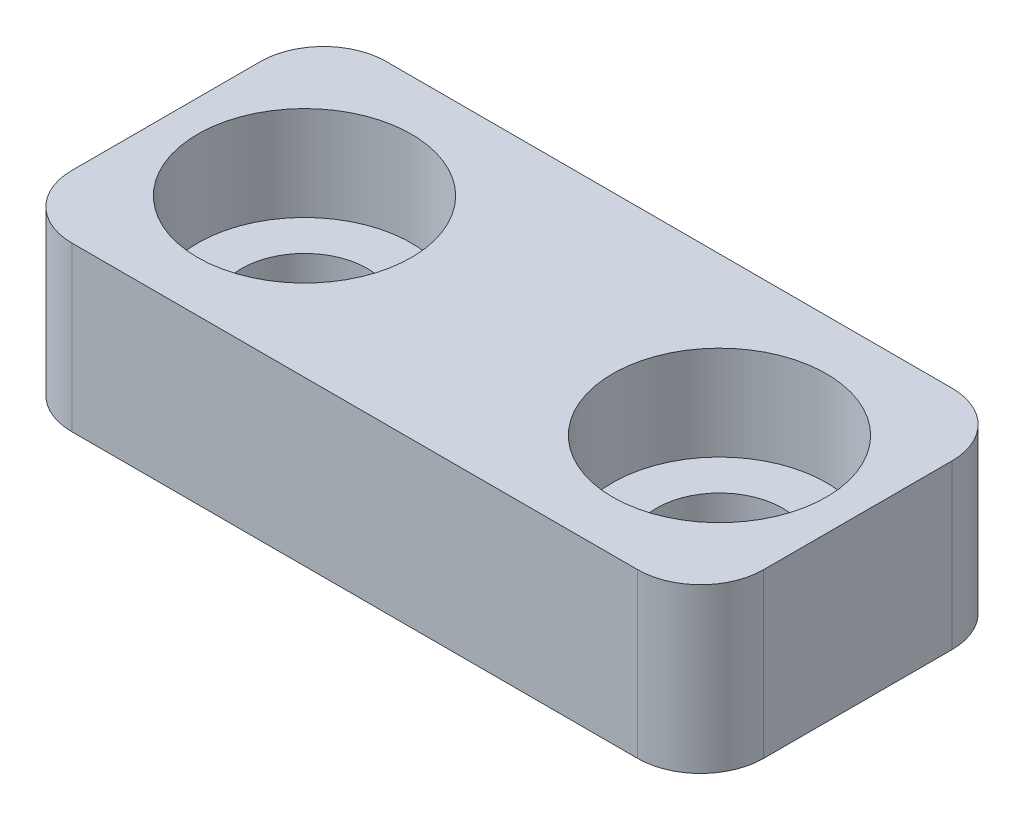
ISO-10303-21;
HEADER;
FILE_DESCRIPTION(('STEP AP214'),'2;1');
FILE_NAME('part.step','',(''),(''),'','','');
FILE_SCHEMA(('AUTOMOTIVE_DESIGN { 1 0 10303 214 1 1 1 1 }'));
ENDSEC;
DATA;
#1=APPLICATION_CONTEXT('core data for automotive mechanical design processes');
#2=APPLICATION_PROTOCOL_DEFINITION('international standard','automotive_design',2000,#1);
#3=PRODUCT_CONTEXT('',#1,'mechanical');
#4=PRODUCT('Part','Part','',(#3));
#5=PRODUCT_RELATED_PRODUCT_CATEGORY('part','',(#4));
#6=PRODUCT_DEFINITION_FORMATION('','',#4);
#7=PRODUCT_DEFINITION_CONTEXT('part definition',#1,'design');
#8=PRODUCT_DEFINITION('design','',#6,#7);
#9=PRODUCT_DEFINITION_SHAPE('','',#8);
#10=(LENGTH_UNIT() NAMED_UNIT(*) SI_UNIT(.MILLI.,.METRE.));
#11=(NAMED_UNIT(*) PLANE_ANGLE_UNIT() SI_UNIT($,.RADIAN.));
#12=(NAMED_UNIT(*) SI_UNIT($,.STERADIAN.) SOLID_ANGLE_UNIT());
#13=UNCERTAINTY_MEASURE_WITH_UNIT(LENGTH_MEASURE(1.E-05),#10,'distance_accuracy_value','');
#14=(GEOMETRIC_REPRESENTATION_CONTEXT(3) GLOBAL_UNCERTAINTY_ASSIGNED_CONTEXT((#13)) GLOBAL_UNIT_ASSIGNED_CONTEXT((#10,
#11,#12)) REPRESENTATION_CONTEXT('',''));
#15=CARTESIAN_POINT('',(0.,0.,0.));
#16=DIRECTION('',(0.,0.,1.));
#17=DIRECTION('',(1.,0.,0.));
#18=AXIS2_PLACEMENT_3D('',#15,#16,#17);
#19=CARTESIAN_POINT('',(-3.3,1.1,0.));
#20=DIRECTION('',(0.,-1.,0.));
#21=DIRECTION('',(0.,0.,-1.));
#22=AXIS2_PLACEMENT_3D('',#19,#20,#21);
#23=CYLINDRICAL_SURFACE('',#22,1.);
#24=CARTESIAN_POINT('',(-3.3,1.1,0.));
#25=DIRECTION('',(0.,-1.,0.));
#26=DIRECTION('',(0.,0.,-1.));
#27=AXIS2_PLACEMENT_3D('',#24,#25,#26);
#28=CIRCLE('',#27,1.);
#29=CARTESIAN_POINT('',(-3.3,1.1,-1.));
#30=VERTEX_POINT('',#29);
#31=EDGE_CURVE('E131',#30,#30,#28,.T.);
#32=ORIENTED_EDGE('',*,*,#31,.F.);
#33=EDGE_LOOP('',(#32));
#34=FACE_BOUND('',#33,.T.);
#35=CARTESIAN_POINT('',(-3.3,0.,0.));
#36=DIRECTION('',(0.,-1.,0.));
#37=DIRECTION('',(0.,0.,-1.));
#38=AXIS2_PLACEMENT_3D('',#35,#36,#37);
#39=CIRCLE('',#38,1.);
#40=CARTESIAN_POINT('',(-3.3,0.,-1.));
#41=VERTEX_POINT('',#40);
#42=EDGE_CURVE('E134',#41,#41,#39,.F.);
#43=ORIENTED_EDGE('',*,*,#42,.F.);
#44=EDGE_LOOP('',(#43));
#45=FACE_BOUND('',#44,.T.);
#46=ADVANCED_FACE('F17',(#34,#45),#23,.F.);
#47=CARTESIAN_POINT('',(-4.5,2.6,-1.5));
#48=DIRECTION('',(0.,-1.,0.));
#49=DIRECTION('',(0.,0.,-1.));
#50=AXIS2_PLACEMENT_3D('',#47,#48,#49);
#51=CYLINDRICAL_SURFACE('',#50,1.);
#52=DIRECTION('',(0.,-1.,0.));
#53=VECTOR('',#52,1.);
#54=CARTESIAN_POINT('',(-4.5,1.3,-2.5));
#55=LINE('',#54,#53);
#56=CARTESIAN_POINT('',(-4.5,2.6,-2.5));
#57=VERTEX_POINT('',#56);
#58=CARTESIAN_POINT('',(-4.5,0.,-2.5));
#59=VERTEX_POINT('',#58);
#60=EDGE_CURVE('E79',#57,#59,#55,.T.);
#61=ORIENTED_EDGE('',*,*,#60,.T.);
#62=CARTESIAN_POINT('',(-4.5,0.,-1.5));
#63=DIRECTION('',(0.,-1.,0.));
#64=DIRECTION('',(0.,0.,-1.));
#65=AXIS2_PLACEMENT_3D('',#62,#63,#64);
#66=CIRCLE('',#65,1.);
#67=CARTESIAN_POINT('',(-5.5,0.,-1.5));
#68=VERTEX_POINT('',#67);
#69=EDGE_CURVE('E75',#68,#59,#66,.T.);
#70=ORIENTED_EDGE('',*,*,#69,.F.);
#71=DIRECTION('',(0.,1.,0.));
#72=VECTOR('',#71,1.);
#73=CARTESIAN_POINT('',(-5.5,1.3,-1.5));
#74=LINE('',#73,#72);
#75=CARTESIAN_POINT('',(-5.5,2.6,-1.5));
#76=VERTEX_POINT('',#75);
#77=EDGE_CURVE('E71',#68,#76,#74,.T.);
#78=ORIENTED_EDGE('',*,*,#77,.T.);
#79=CARTESIAN_POINT('',(-4.5,2.6,-1.5));
#80=DIRECTION('',(0.,-1.,0.));
#81=DIRECTION('',(0.,0.,-1.));
#82=AXIS2_PLACEMENT_3D('',#79,#80,#81);
#83=CIRCLE('',#82,1.);
#84=EDGE_CURVE('E21',#57,#76,#83,.F.);
#85=ORIENTED_EDGE('',*,*,#84,.F.);
#86=EDGE_LOOP('',(#61,#70,#78,#85));
#87=FACE_BOUND('',#86,.T.);
#88=ADVANCED_FACE('F72',(#87),#51,.T.);
#89=CARTESIAN_POINT('',(4.5,2.6,-1.5));
#90=DIRECTION('',(0.,-1.,0.));
#91=DIRECTION('',(0.,0.,-1.));
#92=AXIS2_PLACEMENT_3D('',#89,#90,#91);
#93=CYLINDRICAL_SURFACE('',#92,1.);
#94=DIRECTION('',(0.,-1.,0.));
#95=VECTOR('',#94,1.);
#96=CARTESIAN_POINT('',(5.5,1.3,-1.5));
#97=LINE('',#96,#95);
#98=CARTESIAN_POINT('',(5.5,2.6,-1.5));
#99=VERTEX_POINT('',#98);
#100=CARTESIAN_POINT('',(5.5,0.,-1.5));
#101=VERTEX_POINT('',#100);
#102=EDGE_CURVE('E102',#99,#101,#97,.T.);
#103=ORIENTED_EDGE('',*,*,#102,.T.);
#104=CARTESIAN_POINT('',(4.5,0.,-1.5));
#105=DIRECTION('',(0.,-1.,0.));
#106=DIRECTION('',(0.,0.,-1.));
#107=AXIS2_PLACEMENT_3D('',#104,#105,#106);
#108=CIRCLE('',#107,1.);
#109=CARTESIAN_POINT('',(4.5,0.,-2.5));
#110=VERTEX_POINT('',#109);
#111=EDGE_CURVE('E137',#110,#101,#108,.T.);
#112=ORIENTED_EDGE('',*,*,#111,.F.);
#113=DIRECTION('',(0.,1.,0.));
#114=VECTOR('',#113,1.);
#115=CARTESIAN_POINT('',(4.5,1.3,-2.5));
#116=LINE('',#115,#114);
#117=CARTESIAN_POINT('',(4.5,2.6,-2.5));
#118=VERTEX_POINT('',#117);
#119=EDGE_CURVE('E106',#110,#118,#116,.T.);
#120=ORIENTED_EDGE('',*,*,#119,.T.);
#121=CARTESIAN_POINT('',(4.5,2.6,-1.5));
#122=DIRECTION('',(0.,-1.,0.));
#123=DIRECTION('',(0.,0.,-1.));
#124=AXIS2_PLACEMENT_3D('',#121,#122,#123);
#125=CIRCLE('',#124,1.);
#126=EDGE_CURVE('E68',#99,#118,#125,.F.);
#127=ORIENTED_EDGE('',*,*,#126,.F.);
#128=EDGE_LOOP('',(#103,#112,#120,#127));
#129=FACE_BOUND('',#128,.T.);
#130=ADVANCED_FACE('F155',(#129),#93,.T.);
#131=CARTESIAN_POINT('',(-4.5,2.6,1.5));
#132=DIRECTION('',(0.,-1.,0.));
#133=DIRECTION('',(0.,0.,-1.));
#134=AXIS2_PLACEMENT_3D('',#131,#132,#133);
#135=CYLINDRICAL_SURFACE('',#134,1.);
#136=DIRECTION('',(0.,-1.,0.));
#137=VECTOR('',#136,1.);
#138=CARTESIAN_POINT('',(-5.5,1.3,1.5));
#139=LINE('',#138,#137);
#140=CARTESIAN_POINT('',(-5.5,2.6,1.5));
#141=VERTEX_POINT('',#140);
#142=CARTESIAN_POINT('',(-5.5,0.,1.5));
#143=VERTEX_POINT('',#142);
#144=EDGE_CURVE('E85',#141,#143,#139,.T.);
#145=ORIENTED_EDGE('',*,*,#144,.T.);
#146=CARTESIAN_POINT('',(-4.5,0.,1.5));
#147=DIRECTION('',(0.,-1.,0.));
#148=DIRECTION('',(0.,0.,-1.));
#149=AXIS2_PLACEMENT_3D('',#146,#147,#148);
#150=CIRCLE('',#149,1.);
#151=CARTESIAN_POINT('',(-4.5,0.,2.5));
#152=VERTEX_POINT('',#151);
#153=EDGE_CURVE('E141',#152,#143,#150,.T.);
#154=ORIENTED_EDGE('',*,*,#153,.F.);
#155=DIRECTION('',(0.,1.,0.));
#156=VECTOR('',#155,1.);
#157=CARTESIAN_POINT('',(-4.5,1.3,2.5));
#158=LINE('',#157,#156);
#159=CARTESIAN_POINT('',(-4.5,2.6,2.5));
#160=VERTEX_POINT('',#159);
#161=EDGE_CURVE('E98',#152,#160,#158,.T.);
#162=ORIENTED_EDGE('',*,*,#161,.T.);
#163=CARTESIAN_POINT('',(-4.5,2.6,1.5));
#164=DIRECTION('',(0.,-1.,0.));
#165=DIRECTION('',(0.,0.,-1.));
#166=AXIS2_PLACEMENT_3D('',#163,#164,#165);
#167=CIRCLE('',#166,1.);
#168=EDGE_CURVE('E148',#141,#160,#167,.F.);
#169=ORIENTED_EDGE('',*,*,#168,.F.);
#170=EDGE_LOOP('',(#145,#154,#162,#169));
#171=FACE_BOUND('',#170,.T.);
#172=ADVANCED_FACE('F181',(#171),#135,.T.);
#173=CARTESIAN_POINT('',(4.5,2.6,1.5));
#174=DIRECTION('',(0.,-1.,0.));
#175=DIRECTION('',(0.,0.,-1.));
#176=AXIS2_PLACEMENT_3D('',#173,#174,#175);
#177=CYLINDRICAL_SURFACE('',#176,1.);
#178=DIRECTION('',(0.,-1.,0.));
#179=VECTOR('',#178,1.);
#180=CARTESIAN_POINT('',(4.5,1.3,2.5));
#181=LINE('',#180,#179);
#182=CARTESIAN_POINT('',(4.5,2.6,2.5));
#183=VERTEX_POINT('',#182);
#184=CARTESIAN_POINT('',(4.5,0.,2.5));
#185=VERTEX_POINT('',#184);
#186=EDGE_CURVE('E95',#183,#185,#181,.T.);
#187=ORIENTED_EDGE('',*,*,#186,.T.);
#188=CARTESIAN_POINT('',(4.5,0.,1.5));
#189=DIRECTION('',(0.,-1.,0.));
#190=DIRECTION('',(0.,0.,-1.));
#191=AXIS2_PLACEMENT_3D('',#188,#189,#190);
#192=CIRCLE('',#191,1.);
#193=CARTESIAN_POINT('',(5.5,0.,1.5));
#194=VERTEX_POINT('',#193);
#195=EDGE_CURVE('E144',#194,#185,#192,.T.);
#196=ORIENTED_EDGE('',*,*,#195,.F.);
#197=DIRECTION('',(0.,1.,0.));
#198=VECTOR('',#197,1.);
#199=CARTESIAN_POINT('',(5.5,1.3,1.5));
#200=LINE('',#199,#198);
#201=CARTESIAN_POINT('',(5.5,2.6,1.5));
#202=VERTEX_POINT('',#201);
#203=EDGE_CURVE('E101',#194,#202,#200,.T.);
#204=ORIENTED_EDGE('',*,*,#203,.T.);
#205=CARTESIAN_POINT('',(4.5,2.6,1.5));
#206=DIRECTION('',(0.,-1.,0.));
#207=DIRECTION('',(0.,0.,-1.));
#208=AXIS2_PLACEMENT_3D('',#205,#206,#207);
#209=CIRCLE('',#208,1.);
#210=EDGE_CURVE('E36',#183,#202,#209,.F.);
#211=ORIENTED_EDGE('',*,*,#210,.F.);
#212=EDGE_LOOP('',(#187,#196,#204,#211));
#213=FACE_BOUND('',#212,.T.);
#214=ADVANCED_FACE('F179',(#213),#177,.T.);
#215=CARTESIAN_POINT('',(-5.5,0.,2.5));
#216=DIRECTION('',(0.,-1.,0.));
#217=DIRECTION('',(0.,0.,-1.));
#218=AXIS2_PLACEMENT_3D('',#215,#216,#217);
#219=PLANE('',#218);
#220=CARTESIAN_POINT('',(3.3,0.,0.));
#221=DIRECTION('',(0.,-1.,0.));
#222=DIRECTION('',(0.,0.,-1.));
#223=AXIS2_PLACEMENT_3D('',#220,#221,#222);
#224=CIRCLE('',#223,1.);
#225=CARTESIAN_POINT('',(3.3,0.,-1.));
#226=VERTEX_POINT('',#225);
#227=EDGE_CURVE('E112',#226,#226,#224,.T.);
#228=ORIENTED_EDGE('',*,*,#227,.F.);
#229=EDGE_LOOP('',(#228));
#230=FACE_BOUND('',#229,.T.);
#231=ORIENTED_EDGE('',*,*,#42,.T.);
#232=EDGE_LOOP('',(#231));
#233=FACE_BOUND('',#232,.T.);
#234=DIRECTION('',(1.,0.,0.));
#235=VECTOR('',#234,1.);
#236=CARTESIAN_POINT('',(0.,0.,-2.5));
#237=LINE('',#236,#235);
#238=EDGE_CURVE('E109',#59,#110,#237,.T.);
#239=ORIENTED_EDGE('',*,*,#238,.T.);
#240=ORIENTED_EDGE('',*,*,#111,.T.);
#241=DIRECTION('',(0.,0.,1.));
#242=VECTOR('',#241,1.);
#243=CARTESIAN_POINT('',(5.5,0.,0.));
#244=LINE('',#243,#242);
#245=EDGE_CURVE('E105',#101,#194,#244,.T.);
#246=ORIENTED_EDGE('',*,*,#245,.T.);
#247=ORIENTED_EDGE('',*,*,#195,.T.);
#248=DIRECTION('',(-1.,0.,0.));
#249=VECTOR('',#248,1.);
#250=CARTESIAN_POINT('',(0.,0.,2.5));
#251=LINE('',#250,#249);
#252=EDGE_CURVE('E97',#185,#152,#251,.T.);
#253=ORIENTED_EDGE('',*,*,#252,.T.);
#254=ORIENTED_EDGE('',*,*,#153,.T.);
#255=DIRECTION('',(0.,0.,-1.));
#256=VECTOR('',#255,1.);
#257=CARTESIAN_POINT('',(-5.5,0.,0.));
#258=LINE('',#257,#256);
#259=EDGE_CURVE('E80',#143,#68,#258,.T.);
#260=ORIENTED_EDGE('',*,*,#259,.T.);
#261=ORIENTED_EDGE('',*,*,#69,.T.);
#262=EDGE_LOOP('',(#239,#240,#246,#247,#253,#254,#260,#261));
#263=FACE_BOUND('',#262,.T.);
#264=ADVANCED_FACE('F176',(#230,#233,#263),#219,.T.);
#265=CARTESIAN_POINT('',(-5.0204,1.1,-1.7204));
#266=DIRECTION('',(0.,1.,0.));
#267=DIRECTION('',(0.,0.,1.));
#268=AXIS2_PLACEMENT_3D('',#265,#266,#267);
#269=PLANE('',#268);
#270=ORIENTED_EDGE('',*,*,#31,.T.);
#271=EDGE_LOOP('',(#270));
#272=FACE_BOUND('',#271,.T.);
#273=CARTESIAN_POINT('',(-3.3,1.1,0.));
#274=DIRECTION('',(0.,1.,0.));
#275=DIRECTION('',(0.,0.,1.));
#276=AXIS2_PLACEMENT_3D('',#273,#274,#275);
#277=CIRCLE('',#276,1.7);
#278=CARTESIAN_POINT('',(-3.3,1.1,1.7));
#279=VERTEX_POINT('',#278);
#280=EDGE_CURVE('E91',#279,#279,#277,.F.);
#281=ORIENTED_EDGE('',*,*,#280,.F.);
#282=EDGE_LOOP('',(#281));
#283=FACE_BOUND('',#282,.T.);
#284=ADVANCED_FACE('F188',(#272,#283),#269,.T.);
#285=CARTESIAN_POINT('',(3.3,1.1,0.));
#286=DIRECTION('',(0.,-1.,0.));
#287=DIRECTION('',(0.,0.,-1.));
#288=AXIS2_PLACEMENT_3D('',#285,#286,#287);
#289=CYLINDRICAL_SURFACE('',#288,1.);
#290=CARTESIAN_POINT('',(3.3,1.1,0.));
#291=DIRECTION('',(0.,-1.,0.));
#292=DIRECTION('',(0.,0.,-1.));
#293=AXIS2_PLACEMENT_3D('',#290,#291,#292);
#294=CIRCLE('',#293,1.);
#295=CARTESIAN_POINT('',(3.3,1.1,-1.));
#296=VERTEX_POINT('',#295);
#297=EDGE_CURVE('E86',#296,#296,#294,.T.);
#298=ORIENTED_EDGE('',*,*,#297,.F.);
#299=EDGE_LOOP('',(#298));
#300=FACE_BOUND('',#299,.T.);
#301=ORIENTED_EDGE('',*,*,#227,.T.);
#302=EDGE_LOOP('',(#301));
#303=FACE_BOUND('',#302,.T.);
#304=ADVANCED_FACE('F209',(#300,#303),#289,.F.);
#305=CARTESIAN_POINT('',(-5.5,0.,1.5));
#306=DIRECTION('',(1.,0.,0.));
#307=DIRECTION('',(0.,0.,-1.));
#308=AXIS2_PLACEMENT_3D('',#305,#306,#307);
#309=PLANE('',#308);
#310=ORIENTED_EDGE('',*,*,#77,.F.);
#311=ORIENTED_EDGE('',*,*,#259,.F.);
#312=ORIENTED_EDGE('',*,*,#144,.F.);
#313=DIRECTION('',(0.,0.,-1.));
#314=VECTOR('',#313,1.);
#315=CARTESIAN_POINT('',(-5.5,2.6,0.));
#316=LINE('',#315,#314);
#317=EDGE_CURVE('E65',#141,#76,#316,.T.);
#318=ORIENTED_EDGE('',*,*,#317,.T.);
#319=EDGE_LOOP('',(#310,#311,#312,#318));
#320=FACE_BOUND('',#319,.T.);
#321=ADVANCED_FACE('F83',(#320),#309,.F.);
#322=CARTESIAN_POINT('',(-4.5,0.,-2.5));
#323=DIRECTION('',(0.,0.,1.));
#324=DIRECTION('',(1.,0.,0.));
#325=AXIS2_PLACEMENT_3D('',#322,#323,#324);
#326=PLANE('',#325);
#327=ORIENTED_EDGE('',*,*,#119,.F.);
#328=ORIENTED_EDGE('',*,*,#238,.F.);
#329=ORIENTED_EDGE('',*,*,#60,.F.);
#330=DIRECTION('',(1.,0.,0.));
#331=VECTOR('',#330,1.);
#332=CARTESIAN_POINT('',(0.,2.6,-2.5));
#333=LINE('',#332,#331);
#334=EDGE_CURVE('E67',#57,#118,#333,.T.);
#335=ORIENTED_EDGE('',*,*,#334,.T.);
#336=EDGE_LOOP('',(#327,#328,#329,#335));
#337=FACE_BOUND('',#336,.T.);
#338=ADVANCED_FACE('F159',(#337),#326,.F.);
#339=CARTESIAN_POINT('',(5.5,0.,-1.5));
#340=DIRECTION('',(-1.,0.,0.));
#341=DIRECTION('',(0.,0.,1.));
#342=AXIS2_PLACEMENT_3D('',#339,#340,#341);
#343=PLANE('',#342);
#344=ORIENTED_EDGE('',*,*,#203,.F.);
#345=ORIENTED_EDGE('',*,*,#245,.F.);
#346=ORIENTED_EDGE('',*,*,#102,.F.);
#347=DIRECTION('',(0.,0.,1.));
#348=VECTOR('',#347,1.);
#349=CARTESIAN_POINT('',(5.5,2.6,0.));
#350=LINE('',#349,#348);
#351=EDGE_CURVE('E88',#99,#202,#350,.T.);
#352=ORIENTED_EDGE('',*,*,#351,.T.);
#353=EDGE_LOOP('',(#344,#345,#346,#352));
#354=FACE_BOUND('',#353,.T.);
#355=ADVANCED_FACE('F178',(#354),#343,.F.);
#356=CARTESIAN_POINT('',(4.5,0.,2.5));
#357=DIRECTION('',(0.,0.,-1.));
#358=DIRECTION('',(-1.,0.,0.));
#359=AXIS2_PLACEMENT_3D('',#356,#357,#358);
#360=PLANE('',#359);
#361=ORIENTED_EDGE('',*,*,#186,.F.);
#362=DIRECTION('',(-1.,0.,0.));
#363=VECTOR('',#362,1.);
#364=CARTESIAN_POINT('',(0.,2.6,2.5));
#365=LINE('',#364,#363);
#366=EDGE_CURVE('E125',#183,#160,#365,.T.);
#367=ORIENTED_EDGE('',*,*,#366,.T.);
#368=ORIENTED_EDGE('',*,*,#161,.F.);
#369=ORIENTED_EDGE('',*,*,#252,.F.);
#370=EDGE_LOOP('',(#361,#367,#368,#369));
#371=FACE_BOUND('',#370,.T.);
#372=ADVANCED_FACE('F207',(#371),#360,.F.);
#373=CARTESIAN_POINT('',(-3.3,1.1,0.));
#374=DIRECTION('',(0.,1.,0.));
#375=DIRECTION('',(0.,0.,1.));
#376=AXIS2_PLACEMENT_3D('',#373,#374,#375);
#377=CYLINDRICAL_SURFACE('',#376,1.7);
#378=ORIENTED_EDGE('',*,*,#280,.T.);
#379=EDGE_LOOP('',(#378));
#380=FACE_BOUND('',#379,.T.);
#381=CARTESIAN_POINT('',(-3.3,2.6,0.));
#382=DIRECTION('',(0.,1.,0.));
#383=DIRECTION('',(0.,0.,1.));
#384=AXIS2_PLACEMENT_3D('',#381,#382,#383);
#385=CIRCLE('',#384,1.7);
#386=CARTESIAN_POINT('',(-3.3,2.6,1.7));
#387=VERTEX_POINT('',#386);
#388=EDGE_CURVE('E123',#387,#387,#385,.T.);
#389=ORIENTED_EDGE('',*,*,#388,.T.);
#390=EDGE_LOOP('',(#389));
#391=FACE_BOUND('',#390,.T.);
#392=ADVANCED_FACE('F205',(#380,#391),#377,.F.);
#393=CARTESIAN_POINT('',(1.5796,1.1,-1.7204));
#394=DIRECTION('',(0.,1.,0.));
#395=DIRECTION('',(0.,0.,1.));
#396=AXIS2_PLACEMENT_3D('',#393,#394,#395);
#397=PLANE('',#396);
#398=ORIENTED_EDGE('',*,*,#297,.T.);
#399=EDGE_LOOP('',(#398));
#400=FACE_BOUND('',#399,.T.);
#401=CARTESIAN_POINT('',(3.3,1.1,0.));
#402=DIRECTION('',(0.,1.,0.));
#403=DIRECTION('',(0.,0.,1.));
#404=AXIS2_PLACEMENT_3D('',#401,#402,#403);
#405=CIRCLE('',#404,1.7);
#406=CARTESIAN_POINT('',(3.3,1.1,1.7));
#407=VERTEX_POINT('',#406);
#408=EDGE_CURVE('E27',#407,#407,#405,.F.);
#409=ORIENTED_EDGE('',*,*,#408,.F.);
#410=EDGE_LOOP('',(#409));
#411=FACE_BOUND('',#410,.T.);
#412=ADVANCED_FACE('F201',(#400,#411),#397,.T.);
#413=CARTESIAN_POINT('',(-5.5,2.6,2.5));
#414=DIRECTION('',(0.,-1.,0.));
#415=DIRECTION('',(0.,0.,-1.));
#416=AXIS2_PLACEMENT_3D('',#413,#414,#415);
#417=PLANE('',#416);
#418=ORIENTED_EDGE('',*,*,#388,.F.);
#419=EDGE_LOOP('',(#418));
#420=FACE_BOUND('',#419,.T.);
#421=CARTESIAN_POINT('',(3.3,2.6,0.));
#422=DIRECTION('',(0.,1.,0.));
#423=DIRECTION('',(0.,0.,1.));
#424=AXIS2_PLACEMENT_3D('',#421,#422,#423);
#425=CIRCLE('',#424,1.7);
#426=CARTESIAN_POINT('',(3.3,2.6,1.7));
#427=VERTEX_POINT('',#426);
#428=EDGE_CURVE('E11',#427,#427,#425,.T.);
#429=ORIENTED_EDGE('',*,*,#428,.F.);
#430=EDGE_LOOP('',(#429));
#431=FACE_BOUND('',#430,.T.);
#432=ORIENTED_EDGE('',*,*,#210,.T.);
#433=ORIENTED_EDGE('',*,*,#351,.F.);
#434=ORIENTED_EDGE('',*,*,#126,.T.);
#435=ORIENTED_EDGE('',*,*,#334,.F.);
#436=ORIENTED_EDGE('',*,*,#84,.T.);
#437=ORIENTED_EDGE('',*,*,#317,.F.);
#438=ORIENTED_EDGE('',*,*,#168,.T.);
#439=ORIENTED_EDGE('',*,*,#366,.F.);
#440=EDGE_LOOP('',(#432,#433,#434,#435,#436,#437,#438,#439));
#441=FACE_BOUND('',#440,.T.);
#442=ADVANCED_FACE('F19',(#420,#431,#441),#417,.F.);
#443=CARTESIAN_POINT('',(3.3,1.1,0.));
#444=DIRECTION('',(0.,1.,0.));
#445=DIRECTION('',(0.,0.,1.));
#446=AXIS2_PLACEMENT_3D('',#443,#444,#445);
#447=CYLINDRICAL_SURFACE('',#446,1.7);
#448=ORIENTED_EDGE('',*,*,#408,.T.);
#449=EDGE_LOOP('',(#448));
#450=FACE_BOUND('',#449,.T.);
#451=ORIENTED_EDGE('',*,*,#428,.T.);
#452=EDGE_LOOP('',(#451));
#453=FACE_BOUND('',#452,.T.);
#454=ADVANCED_FACE('F194',(#450,#453),#447,.F.);
#455=CLOSED_SHELL('',(#46,#88,#130,#172,#214,#264,#284,#304,#321,#338,#355,#372,#392,#412,#442,#454));
#456=MANIFOLD_SOLID_BREP('B1',#455);
#457=ADVANCED_BREP_SHAPE_REPRESENTATION('',(#18,#456),#14);
#458=SHAPE_DEFINITION_REPRESENTATION(#9,#457);
ENDSEC;
END-ISO-10303-21;
